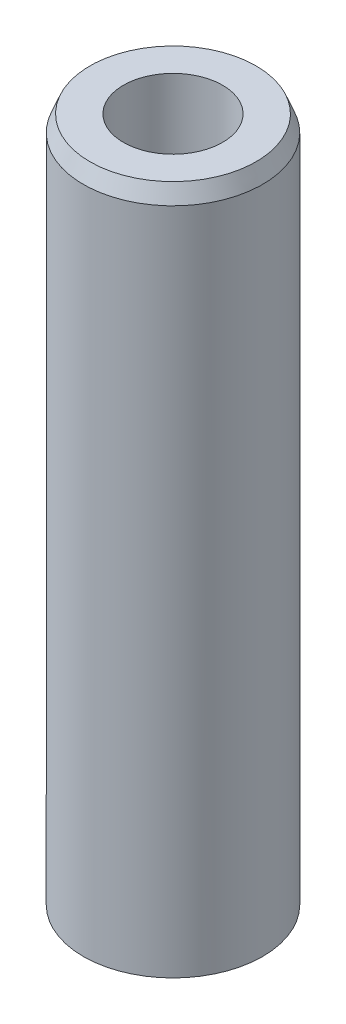
ISO-10303-21;
HEADER;
FILE_DESCRIPTION(('STEP AP214'),'2;1');
FILE_NAME('part.step','',(''),(''),'','','');
FILE_SCHEMA(('AUTOMOTIVE_DESIGN { 1 0 10303 214 1 1 1 1 }'));
ENDSEC;
DATA;
#1=APPLICATION_CONTEXT('core data for automotive mechanical design processes');
#2=APPLICATION_PROTOCOL_DEFINITION('international standard','automotive_design',2000,#1);
#3=PRODUCT_CONTEXT('',#1,'mechanical');
#4=PRODUCT('Part','Part','',(#3));
#5=PRODUCT_RELATED_PRODUCT_CATEGORY('part','',(#4));
#6=PRODUCT_DEFINITION_FORMATION('','',#4);
#7=PRODUCT_DEFINITION_CONTEXT('part definition',#1,'design');
#8=PRODUCT_DEFINITION('design','',#6,#7);
#9=PRODUCT_DEFINITION_SHAPE('','',#8);
#10=(LENGTH_UNIT() NAMED_UNIT(*) SI_UNIT(.MILLI.,.METRE.));
#11=(NAMED_UNIT(*) PLANE_ANGLE_UNIT() SI_UNIT($,.RADIAN.));
#12=(NAMED_UNIT(*) SI_UNIT($,.STERADIAN.) SOLID_ANGLE_UNIT());
#13=UNCERTAINTY_MEASURE_WITH_UNIT(LENGTH_MEASURE(1.E-05),#10,'distance_accuracy_value','');
#14=(GEOMETRIC_REPRESENTATION_CONTEXT(3) GLOBAL_UNCERTAINTY_ASSIGNED_CONTEXT((#13)) GLOBAL_UNIT_ASSIGNED_CONTEXT((#10,
#11,#12)) REPRESENTATION_CONTEXT('',''));
#15=CARTESIAN_POINT('',(0.,0.,0.));
#16=DIRECTION('',(0.,0.,1.));
#17=DIRECTION('',(1.,0.,0.));
#18=AXIS2_PLACEMENT_3D('',#15,#16,#17);
#19=CARTESIAN_POINT('',(0.,77.1552318753627,0.));
#20=DIRECTION('',(0.,-1.,0.));
#21=DIRECTION('',(0.,0.,-1.));
#22=AXIS2_PLACEMENT_3D('',#19,#20,#21);
#23=CYLINDRICAL_SURFACE('',#22,10.);
#24=CARTESIAN_POINT('',(0.,75.330121526372,0.));
#25=DIRECTION('',(0.,1.,0.));
#26=DIRECTION('',(0.,0.,1.));
#27=AXIS2_PLACEMENT_3D('',#24,#25,#26);
#28=CIRCLE('',#27,10.);
#29=CARTESIAN_POINT('',(0.,75.330121526372,-10.));
#30=VERTEX_POINT('',#29);
#31=EDGE_CURVE('E50',#30,#30,#28,.F.);
#32=CARTESIAN_POINT('',(0.,0.732391665569848,0.));
#33=DIRECTION('',(0.,1.,0.));
#34=DIRECTION('',(0.,0.,1.));
#35=AXIS2_PLACEMENT_3D('',#32,#33,#34);
#36=CIRCLE('',#35,10.);
#37=CARTESIAN_POINT('',(0.,0.732391665569834,-10.));
#38=VERTEX_POINT('',#37);
#39=EDGE_CURVE('E51',#38,#38,#36,.T.);
#40=CARTESIAN_POINT('',(0.,75.330121526372,-10.));
#41=CARTESIAN_POINT('',(0.,74.5530618403219,-10.));
#42=CARTESIAN_POINT('',(0.,73.7760021542719,-10.));
#43=CARTESIAN_POINT('',(0.,72.2218827821719,-10.));
#44=CARTESIAN_POINT('',(0.,71.4448230961218,-10.));
#45=CARTESIAN_POINT('',(0.,69.8907037240218,-10.));
#46=CARTESIAN_POINT('',(0.,69.1136440379718,-10.));
#47=CARTESIAN_POINT('',(0.,67.5595246658717,-10.));
#48=CARTESIAN_POINT('',(0.,66.7824649798217,-10.));
#49=CARTESIAN_POINT('',(0.,65.2283456077217,-10.));
#50=CARTESIAN_POINT('',(0.,64.4512859216716,-10.));
#51=CARTESIAN_POINT('',(0.,62.8971665495716,-10.));
#52=CARTESIAN_POINT('',(0.,62.1201068635216,-10.));
#53=CARTESIAN_POINT('',(0.,60.5659874914215,-10.));
#54=CARTESIAN_POINT('',(0.,59.7889278053715,-10.));
#55=CARTESIAN_POINT('',(0.,58.2348084332715,-10.));
#56=CARTESIAN_POINT('',(0.,57.4577487472214,-10.));
#57=CARTESIAN_POINT('',(0.,55.9036293751214,-10.));
#58=CARTESIAN_POINT('',(0.,55.1265696890714,-10.));
#59=CARTESIAN_POINT('',(0.,53.5724503169713,-10.));
#60=CARTESIAN_POINT('',(0.,52.7953906309213,-10.));
#61=CARTESIAN_POINT('',(0.,51.2412712588213,-10.));
#62=CARTESIAN_POINT('',(0.,50.4642115727712,-10.));
#63=CARTESIAN_POINT('',(0.,48.9100922006712,-10.));
#64=CARTESIAN_POINT('',(0.,48.1330325146212,-10.));
#65=CARTESIAN_POINT('',(0.,46.5789131425211,-10.));
#66=CARTESIAN_POINT('',(0.,45.8018534564711,-10.));
#67=CARTESIAN_POINT('',(0.,44.2477340843711,-10.));
#68=CARTESIAN_POINT('',(0.,43.4706743983211,-10.));
#69=CARTESIAN_POINT('',(0.,41.916555026221,-10.));
#70=CARTESIAN_POINT('',(0.,41.139495340171,-10.));
#71=CARTESIAN_POINT('',(0.,39.5853759680709,-10.));
#72=CARTESIAN_POINT('',(0.,38.8083162820209,-10.));
#73=CARTESIAN_POINT('',(0.,37.2541969099209,-10.));
#74=CARTESIAN_POINT('',(0.,36.4771372238709,-10.));
#75=CARTESIAN_POINT('',(0.,34.9230178517708,-10.));
#76=CARTESIAN_POINT('',(0.,34.1459581657208,-10.));
#77=CARTESIAN_POINT('',(0.,32.5918387936207,-10.));
#78=CARTESIAN_POINT('',(0.,31.8147791075707,-10.));
#79=CARTESIAN_POINT('',(0.,30.2606597354707,-10.));
#80=CARTESIAN_POINT('',(0.,29.4836000494207,-10.));
#81=CARTESIAN_POINT('',(0.,27.9294806773206,-10.));
#82=CARTESIAN_POINT('',(0.,27.1524209912706,-10.));
#83=CARTESIAN_POINT('',(0.,25.5983016191705,-10.));
#84=CARTESIAN_POINT('',(0.,24.8212419331205,-10.));
#85=CARTESIAN_POINT('',(0.,23.2671225610205,-10.));
#86=CARTESIAN_POINT('',(0.,22.4900628749705,-10.));
#87=CARTESIAN_POINT('',(0.,20.9359435028704,-10.));
#88=CARTESIAN_POINT('',(0.,20.1588838168204,-10.));
#89=CARTESIAN_POINT('',(0.,18.6047644447203,-10.));
#90=CARTESIAN_POINT('',(0.,17.8277047586703,-10.));
#91=CARTESIAN_POINT('',(0.,16.2735853865703,-10.));
#92=CARTESIAN_POINT('',(0.,15.4965257005203,-10.));
#93=CARTESIAN_POINT('',(0.,13.9424063284202,-10.));
#94=CARTESIAN_POINT('',(0.,13.1653466423702,-10.));
#95=CARTESIAN_POINT('',(0.,11.6112272702702,-10.));
#96=CARTESIAN_POINT('',(0.,10.8341675842201,-10.));
#97=CARTESIAN_POINT('',(0.,9.28004821212009,-10.));
#98=CARTESIAN_POINT('',(0.,8.50298852607006,-10.));
#99=CARTESIAN_POINT('',(0.,6.94886915397001,-10.));
#100=CARTESIAN_POINT('',(0.,6.17180946791999,-10.));
#101=CARTESIAN_POINT('',(0.,4.61769009581996,-10.));
#102=CARTESIAN_POINT('',(0.,3.84063040976994,-10.));
#103=CARTESIAN_POINT('',(0.,2.28651103766989,-10.));
#104=CARTESIAN_POINT('',(0.,1.50945135161986,-10.));
#105=CARTESIAN_POINT('',(0.,0.732391665569834,-10.));
#106=B_SPLINE_CURVE_WITH_KNOTS('',3,(#40,#41,#42,#43,#44,#45,#46,#47,#48,#49,#50,#51,#52,#53,
#54,#55,#56,#57,#58,#59,#60,#61,#62,#63,#64,#65,#66,#67,#68,#69,#70,#71,#72,#73,#74,#75,#76,#77,
#78,#79,#80,#81,#82,#83,#84,#85,#86,#87,#88,#89,#90,#91,#92,#93,#94,#95,#96,#97,#98,#99,#100,
#101,#102,#103,#104,#105),.UNSPECIFIED.,.F.,.F.,(4,2,2,2,2,2,2,2,2,2,2,2,2,2,2,2,2,2,2,2,2,2,2,
2,2,2,2,2,2,2,2,2,4),(0.,2.33117905815007,4.66235811630014,6.9935371744502,9.32471623260027,
11.6558952907503,13.9870743489004,16.3182534070505,18.6494324652005,20.9806115233506,
23.3117905815007,25.6429696396507,27.9741486978008,30.3053277559509,32.6365068141009,
34.967685872251,37.2988649304011,39.6300439885511,41.9612230467012,44.2924021048513,
46.6235811630013,48.9547602211514,51.2859392793015,53.6171183374515,55.9482973956016,
58.2794764537517,60.6106555119017,62.9418345700518,65.2730136282018,67.6041926863519,
69.935371744502,72.266550802652,74.5977298608021),.UNSPECIFIED.);
#107=EDGE_CURVE('BSEAM39',#30,#38,#106,.T.);
#108=ORIENTED_EDGE('',*,*,#31,.T.);
#109=ORIENTED_EDGE('',*,*,#39,.T.);
#110=ORIENTED_EDGE('',*,*,#107,.T.);
#111=ORIENTED_EDGE('',*,*,#107,.F.);
#112=EDGE_LOOP('',(#108,#110,#109,#111));
#113=FACE_BOUND('',#112,.T.);
#114=ADVANCED_FACE('F39',(#113),#23,.T.);
#115=CARTESIAN_POINT('',(0.,77.1552318753627,0.));
#116=DIRECTION('',(0.,1.,0.));
#117=DIRECTION('',(0.,0.,1.));
#118=AXIS2_PLACEMENT_3D('',#115,#116,#117);
#119=PLANE('',#118);
#120=CARTESIAN_POINT('',(0.,77.1552318753627,0.));
#121=DIRECTION('',(0.,1.,0.));
#122=DIRECTION('',(0.,0.,1.));
#123=AXIS2_PLACEMENT_3D('',#120,#121,#122);
#124=CIRCLE('',#123,9.26760833443026);
#125=CARTESIAN_POINT('',(0.,77.1552318753627,9.26760833443026));
#126=VERTEX_POINT('',#125);
#127=EDGE_CURVE('E54',#126,#126,#124,.T.);
#128=ORIENTED_EDGE('',*,*,#127,.T.);
#129=EDGE_LOOP('',(#128));
#130=FACE_BOUND('',#129,.T.);
#131=CARTESIAN_POINT('',(0.,77.1552318753627,0.));
#132=DIRECTION('',(0.,1.,0.));
#133=DIRECTION('',(0.,0.,1.));
#134=AXIS2_PLACEMENT_3D('',#131,#132,#133);
#135=CIRCLE('',#134,5.53103390601158);
#136=CARTESIAN_POINT('',(0.,77.1552318753627,-5.53103390601158));
#137=VERTEX_POINT('',#136);
#138=EDGE_CURVE('E58',#137,#137,#135,.T.);
#139=ORIENTED_EDGE('',*,*,#138,.F.);
#140=EDGE_LOOP('',(#139));
#141=FACE_BOUND('',#140,.T.);
#142=ADVANCED_FACE('F69',(#130,#141),#119,.T.);
#143=CARTESIAN_POINT('',(0.,0.,0.));
#144=DIRECTION('',(0.,1.,0.));
#145=DIRECTION('',(0.,0.,1.));
#146=AXIS2_PLACEMENT_3D('',#143,#144,#145);
#147=PLANE('',#146);
#148=CARTESIAN_POINT('',(0.,0.,0.));
#149=DIRECTION('',(0.,1.,0.));
#150=DIRECTION('',(0.,0.,1.));
#151=AXIS2_PLACEMENT_3D('',#148,#149,#150);
#152=CIRCLE('',#151,8.17488965100896);
#153=CARTESIAN_POINT('',(0.,0.,8.17488965100896));
#154=VERTEX_POINT('',#153);
#155=EDGE_CURVE('E10',#154,#154,#152,.F.);
#156=ORIENTED_EDGE('',*,*,#155,.T.);
#157=EDGE_LOOP('',(#156));
#158=FACE_BOUND('',#157,.T.);
#159=CARTESIAN_POINT('',(0.,0.,0.));
#160=DIRECTION('',(0.,1.,0.));
#161=DIRECTION('',(0.,0.,1.));
#162=AXIS2_PLACEMENT_3D('',#159,#160,#161);
#163=CIRCLE('',#162,5.53103390601158);
#164=CARTESIAN_POINT('',(0.,0.,-5.53103390601158));
#165=VERTEX_POINT('',#164);
#166=EDGE_CURVE('E63',#165,#165,#163,.T.);
#167=ORIENTED_EDGE('',*,*,#166,.T.);
#168=EDGE_LOOP('',(#167));
#169=FACE_BOUND('',#168,.T.);
#170=ADVANCED_FACE('F75',(#158,#169),#147,.F.);
#171=CARTESIAN_POINT('',(0.,77.1552318753627,0.));
#172=DIRECTION('',(0.,-1.,0.));
#173=DIRECTION('',(0.,0.,-1.));
#174=AXIS2_PLACEMENT_3D('',#171,#172,#173);
#175=CYLINDRICAL_SURFACE('',#174,5.53103390601158);
#176=CARTESIAN_POINT('',(0.,77.1552318753627,-5.53103390601158));
#177=CARTESIAN_POINT('',(0.,76.3515315433277,-5.53103390601158));
#178=CARTESIAN_POINT('',(0.,75.5478312112927,-5.53103390601158));
#179=CARTESIAN_POINT('',(0.,73.9404305472226,-5.53103390601158));
#180=CARTESIAN_POINT('',(0.,73.1367302151876,-5.53103390601158));
#181=CARTESIAN_POINT('',(0.,71.5293295511175,-5.53103390601158));
#182=CARTESIAN_POINT('',(0.,70.7256292190825,-5.53103390601158));
#183=CARTESIAN_POINT('',(0.,69.1182285550124,-5.53103390601158));
#184=CARTESIAN_POINT('',(0.,68.3145282229774,-5.53103390601158));
#185=CARTESIAN_POINT('',(0.,66.7071275589073,-5.53103390601158));
#186=CARTESIAN_POINT('',(0.,65.9034272268723,-5.53103390601158));
#187=CARTESIAN_POINT('',(0.,64.2960265628023,-5.53103390601158));
#188=CARTESIAN_POINT('',(0.,63.4923262307672,-5.53103390601158));
#189=CARTESIAN_POINT('',(0.,61.8849255666972,-5.53103390601158));
#190=CARTESIAN_POINT('',(0.,61.0812252346621,-5.53103390601158));
#191=CARTESIAN_POINT('',(0.,59.4738245705921,-5.53103390601158));
#192=CARTESIAN_POINT('',(0.,58.6701242385571,-5.53103390601158));
#193=CARTESIAN_POINT('',(0.,57.062723574487,-5.53103390601158));
#194=CARTESIAN_POINT('',(0.,56.259023242452,-5.53103390601158));
#195=CARTESIAN_POINT('',(0.,54.6516225783819,-5.53103390601158));
#196=CARTESIAN_POINT('',(0.,53.8479222463469,-5.53103390601158));
#197=CARTESIAN_POINT('',(0.,52.2405215822768,-5.53103390601158));
#198=CARTESIAN_POINT('',(0.,51.4368212502418,-5.53103390601158));
#199=CARTESIAN_POINT('',(0.,49.8294205861717,-5.53103390601158));
#200=CARTESIAN_POINT('',(0.,49.0257202541367,-5.53103390601158));
#201=CARTESIAN_POINT('',(0.,47.4183195900667,-5.53103390601158));
#202=CARTESIAN_POINT('',(0.,46.6146192580316,-5.53103390601158));
#203=CARTESIAN_POINT('',(0.,45.0072185939616,-5.53103390601158));
#204=CARTESIAN_POINT('',(0.,44.2035182619265,-5.53103390601158));
#205=CARTESIAN_POINT('',(0.,42.5961175978565,-5.53103390601158));
#206=CARTESIAN_POINT('',(0.,41.7924172658215,-5.53103390601158));
#207=CARTESIAN_POINT('',(0.,40.1850166017514,-5.53103390601158));
#208=CARTESIAN_POINT('',(0.,39.3813162697164,-5.53103390601158));
#209=CARTESIAN_POINT('',(0.,37.7739156056463,-5.53103390601158));
#210=CARTESIAN_POINT('',(0.,36.9702152736113,-5.53103390601158));
#211=CARTESIAN_POINT('',(0.,35.3628146095412,-5.53103390601158));
#212=CARTESIAN_POINT('',(0.,34.5591142775062,-5.53103390601158));
#213=CARTESIAN_POINT('',(0.,32.9517136134361,-5.53103390601158));
#214=CARTESIAN_POINT('',(0.,32.1480132814011,-5.53103390601158));
#215=CARTESIAN_POINT('',(0.,30.5406126173311,-5.53103390601158));
#216=CARTESIAN_POINT('',(0.,29.736912285296,-5.53103390601158));
#217=CARTESIAN_POINT('',(0.,28.129511621226,-5.53103390601158));
#218=CARTESIAN_POINT('',(0.,27.3258112891909,-5.53103390601158));
#219=CARTESIAN_POINT('',(0.,25.7184106251209,-5.53103390601158));
#220=CARTESIAN_POINT('',(0.,24.9147102930859,-5.53103390601158));
#221=CARTESIAN_POINT('',(0.,23.3073096290158,-5.53103390601158));
#222=CARTESIAN_POINT('',(0.,22.5036092969808,-5.53103390601158));
#223=CARTESIAN_POINT('',(0.,20.8962086329107,-5.53103390601158));
#224=CARTESIAN_POINT('',(0.,20.0925083008757,-5.53103390601158));
#225=CARTESIAN_POINT('',(0.,18.4851076368056,-5.53103390601158));
#226=CARTESIAN_POINT('',(0.,17.6814073047706,-5.53103390601158));
#227=CARTESIAN_POINT('',(0.,16.0740066407005,-5.53103390601158));
#228=CARTESIAN_POINT('',(0.,15.2703063086655,-5.53103390601158));
#229=CARTESIAN_POINT('',(0.,13.6629056445955,-5.53103390601158));
#230=CARTESIAN_POINT('',(0.,12.8592053125604,-5.53103390601158));
#231=CARTESIAN_POINT('',(0.,11.2518046484904,-5.53103390601158));
#232=CARTESIAN_POINT('',(0.,10.4481043164554,-5.53103390601158));
#233=CARTESIAN_POINT('',(0.,8.8407036523853,-5.53103390601158));
#234=CARTESIAN_POINT('',(0.,8.03700332035027,-5.53103390601158));
#235=CARTESIAN_POINT('',(0.,6.42960265628022,-5.53103390601158));
#236=CARTESIAN_POINT('',(0.,5.62590232424519,-5.53103390601158));
#237=CARTESIAN_POINT('',(0.,4.01850166017513,-5.53103390601158));
#238=CARTESIAN_POINT('',(0.,3.2148013281401,-5.53103390601158));
#239=CARTESIAN_POINT('',(0.,1.60740066407004,-5.53103390601158));
#240=CARTESIAN_POINT('',(0.,0.803700332035015,-5.53103390601158));
#241=CARTESIAN_POINT('',(0.,0.,-5.53103390601158));
#242=B_SPLINE_CURVE_WITH_KNOTS('',3,(#176,#177,#178,#179,#180,#181,#182,#183,#184,#185,#186,
#187,#188,#189,#190,#191,#192,#193,#194,#195,#196,#197,#198,#199,#200,#201,#202,#203,#204,#205,
#206,#207,#208,#209,#210,#211,#212,#213,#214,#215,#216,#217,#218,#219,#220,#221,#222,#223,#224,
#225,#226,#227,#228,#229,#230,#231,#232,#233,#234,#235,#236,#237,#238,#239,#240,#241),
.UNSPECIFIED.,.F.,.F.,(4,2,2,2,2,2,2,2,2,2,2,2,2,2,2,2,2,2,2,2,2,2,2,2,2,2,2,2,2,2,2,2,4),(0.,
2.41110099610509,4.82220199221017,7.23330298831526,9.64440398442035,12.0555049805254,
14.4666059766305,16.8777069727356,19.2888079688407,21.6999089649458,24.1110099610509,
26.5221109571559,28.933211953261,31.3443129493661,33.7554139454712,36.1665149415763,
38.5776159376814,40.9887169337865,43.3998179298915,45.8109189259966,48.2220199221017,
50.6331209182068,53.0442219143119,55.455322910417,57.8664239065221,60.2775249026271,
62.6886258987322,65.0997268948373,67.5108278909424,69.9219288870475,72.3330298831526,
74.7441308792576,77.1552318753627),.UNSPECIFIED.);
#243=EDGE_CURVE('BSEAM70',#137,#165,#242,.T.);
#244=ORIENTED_EDGE('',*,*,#138,.T.);
#245=ORIENTED_EDGE('',*,*,#166,.F.);
#246=ORIENTED_EDGE('',*,*,#243,.T.);
#247=ORIENTED_EDGE('',*,*,#243,.F.);
#248=EDGE_LOOP('',(#244,#246,#245,#247));
#249=FACE_BOUND('',#248,.T.);
#250=ADVANCED_FACE('F70',(#249),#175,.F.);
#251=CARTESIAN_POINT('',(0.,77.1552318753627,0.));
#252=DIRECTION('',(0.,-1.,0.));
#253=DIRECTION('',(0.,0.,-1.));
#254=AXIS2_PLACEMENT_3D('',#251,#252,#253);
#255=CONICAL_SURFACE('',#254,9.26760833443026,0.381614710793655);
#256=ORIENTED_EDGE('',*,*,#31,.F.);
#257=EDGE_LOOP('',(#256));
#258=FACE_BOUND('',#257,.T.);
#259=ORIENTED_EDGE('',*,*,#127,.F.);
#260=EDGE_LOOP('',(#259));
#261=FACE_BOUND('',#260,.T.);
#262=ADVANCED_FACE('F81',(#258,#261),#255,.T.);
#263=CARTESIAN_POINT('',(0.,0.732391665569848,0.));
#264=DIRECTION('',(0.,1.,0.));
#265=DIRECTION('',(0.,0.,1.));
#266=AXIS2_PLACEMENT_3D('',#263,#264,#265);
#267=CONICAL_SURFACE('',#266,10.,1.18918161600124);
#268=ORIENTED_EDGE('',*,*,#155,.F.);
#269=EDGE_LOOP('',(#268));
#270=FACE_BOUND('',#269,.T.);
#271=ORIENTED_EDGE('',*,*,#39,.F.);
#272=EDGE_LOOP('',(#271));
#273=FACE_BOUND('',#272,.T.);
#274=ADVANCED_FACE('F45',(#270,#273),#267,.T.);
#275=CLOSED_SHELL('',(#114,#142,#170,#250,#262,#274));
#276=MANIFOLD_SOLID_BREP('B2',#275);
#277=ADVANCED_BREP_SHAPE_REPRESENTATION('',(#18,#276),#14);
#278=SHAPE_DEFINITION_REPRESENTATION(#9,#277);
ENDSEC;
END-ISO-10303-21;
